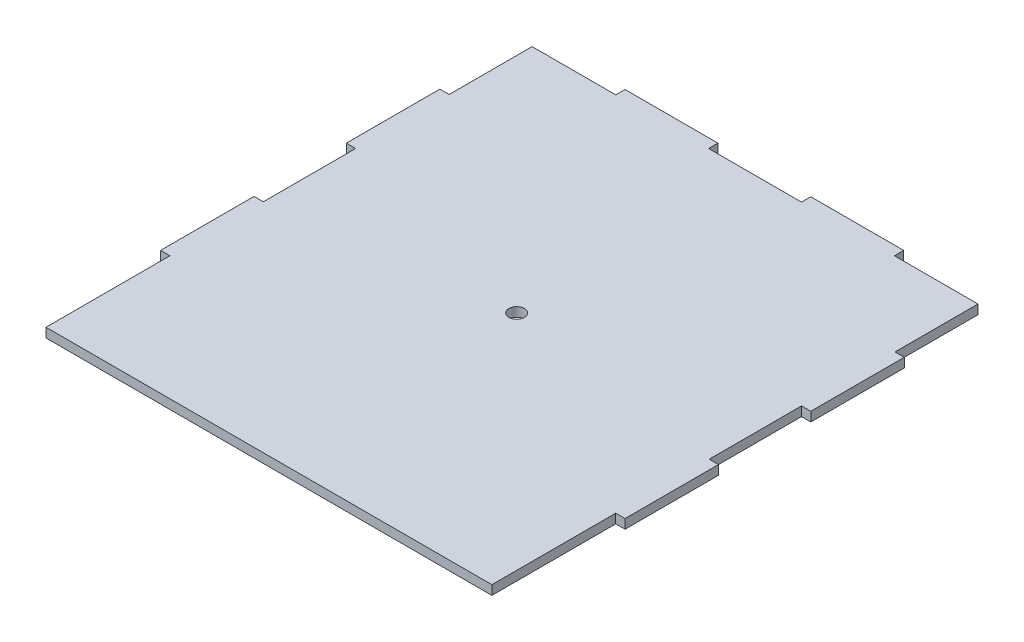
ISO-10303-21;
HEADER;
FILE_DESCRIPTION(('STEP AP214'),'2;1');
FILE_NAME('part.step','',(''),(''),'','','');
FILE_SCHEMA(('AUTOMOTIVE_DESIGN { 1 0 10303 214 1 1 1 1 }'));
ENDSEC;
DATA;
#1=APPLICATION_CONTEXT('core data for automotive mechanical design processes');
#2=APPLICATION_PROTOCOL_DEFINITION('international standard','automotive_design',2000,#1);
#3=PRODUCT_CONTEXT('',#1,'mechanical');
#4=PRODUCT('Part','Part','',(#3));
#5=PRODUCT_RELATED_PRODUCT_CATEGORY('part','',(#4));
#6=PRODUCT_DEFINITION_FORMATION('','',#4);
#7=PRODUCT_DEFINITION_CONTEXT('part definition',#1,'design');
#8=PRODUCT_DEFINITION('design','',#6,#7);
#9=PRODUCT_DEFINITION_SHAPE('','',#8);
#10=(LENGTH_UNIT() NAMED_UNIT(*) SI_UNIT(.MILLI.,.METRE.));
#11=(NAMED_UNIT(*) PLANE_ANGLE_UNIT() SI_UNIT($,.RADIAN.));
#12=(NAMED_UNIT(*) SI_UNIT($,.STERADIAN.) SOLID_ANGLE_UNIT());
#13=UNCERTAINTY_MEASURE_WITH_UNIT(LENGTH_MEASURE(1.E-05),#10,'distance_accuracy_value','');
#14=(GEOMETRIC_REPRESENTATION_CONTEXT(3) GLOBAL_UNCERTAINTY_ASSIGNED_CONTEXT((#13)) GLOBAL_UNIT_ASSIGNED_CONTEXT((#10,
#11,#12)) REPRESENTATION_CONTEXT('',''));
#15=CARTESIAN_POINT('',(0.,0.,0.));
#16=DIRECTION('',(0.,0.,1.));
#17=DIRECTION('',(1.,0.,0.));
#18=AXIS2_PLACEMENT_3D('',#15,#16,#17);
#19=CARTESIAN_POINT('',(0.,3.,0.));
#20=DIRECTION('',(0.,0.,-1.));
#21=DIRECTION('',(-1.,0.,0.));
#22=AXIS2_PLACEMENT_3D('',#19,#20,#21);
#23=PLANE('',#22);
#24=DIRECTION('',(1.,0.,0.));
#25=VECTOR('',#24,1.);
#26=CARTESIAN_POINT('',(0.,0.,0.));
#27=LINE('',#26,#25);
#28=CARTESIAN_POINT('',(3.00000000000114,0.,0.));
#29=VERTEX_POINT('',#28);
#30=CARTESIAN_POINT('',(147.,0.,0.));
#31=VERTEX_POINT('',#30);
#32=EDGE_CURVE('E259',#29,#31,#27,.T.);
#33=ORIENTED_EDGE('',*,*,#32,.T.);
#34=DIRECTION('',(0.,-1.,0.));
#35=VECTOR('',#34,1.);
#36=CARTESIAN_POINT('',(147.,3.,0.));
#37=LINE('',#36,#35);
#38=CARTESIAN_POINT('',(147.,3.,0.));
#39=VERTEX_POINT('',#38);
#40=EDGE_CURVE('E11',#39,#31,#37,.T.);
#41=ORIENTED_EDGE('',*,*,#40,.F.);
#42=DIRECTION('',(1.,0.,0.));
#43=VECTOR('',#42,1.);
#44=CARTESIAN_POINT('',(0.,3.,0.));
#45=LINE('',#44,#43);
#46=CARTESIAN_POINT('',(3.00000000000114,3.,0.));
#47=VERTEX_POINT('',#46);
#48=EDGE_CURVE('E796',#47,#39,#45,.T.);
#49=ORIENTED_EDGE('',*,*,#48,.F.);
#50=DIRECTION('',(0.,-1.,0.));
#51=VECTOR('',#50,1.);
#52=CARTESIAN_POINT('',(3.00000000000114,3.,0.));
#53=LINE('',#52,#51);
#54=EDGE_CURVE('E53',#47,#29,#53,.T.);
#55=ORIENTED_EDGE('',*,*,#54,.T.);
#56=EDGE_LOOP('',(#33,#41,#49,#55));
#57=FACE_BOUND('',#56,.T.);
#58=ADVANCED_FACE('F36',(#57),#23,.F.);
#59=CARTESIAN_POINT('',(147.,3.,0.));
#60=DIRECTION('',(-1.,0.,0.));
#61=DIRECTION('',(0.,0.,1.));
#62=AXIS2_PLACEMENT_3D('',#59,#60,#61);
#63=PLANE('',#62);
#64=DIRECTION('',(0.,0.,-1.));
#65=VECTOR('',#64,1.);
#66=CARTESIAN_POINT('',(147.,0.,0.));
#67=LINE('',#66,#65);
#68=CARTESIAN_POINT('',(147.,0.,-40.));
#69=VERTEX_POINT('',#68);
#70=EDGE_CURVE('E261',#31,#69,#67,.T.);
#71=ORIENTED_EDGE('',*,*,#70,.T.);
#72=DIRECTION('',(0.,-1.,0.));
#73=VECTOR('',#72,1.);
#74=CARTESIAN_POINT('',(147.,3.,-40.));
#75=LINE('',#74,#73);
#76=CARTESIAN_POINT('',(147.,3.,-40.));
#77=VERTEX_POINT('',#76);
#78=EDGE_CURVE('E45',#77,#69,#75,.T.);
#79=ORIENTED_EDGE('',*,*,#78,.F.);
#80=DIRECTION('',(0.,0.,-1.));
#81=VECTOR('',#80,1.);
#82=CARTESIAN_POINT('',(147.,3.,0.));
#83=LINE('',#82,#81);
#84=EDGE_CURVE('E151',#39,#77,#83,.T.);
#85=ORIENTED_EDGE('',*,*,#84,.F.);
#86=ORIENTED_EDGE('',*,*,#40,.T.);
#87=EDGE_LOOP('',(#71,#79,#85,#86));
#88=FACE_BOUND('',#87,.T.);
#89=ADVANCED_FACE('F470',(#88),#63,.F.);
#90=CARTESIAN_POINT('',(0.,3.,-40.));
#91=DIRECTION('',(0.,0.,-1.));
#92=DIRECTION('',(-1.,0.,0.));
#93=AXIS2_PLACEMENT_3D('',#90,#91,#92);
#94=PLANE('',#93);
#95=DIRECTION('',(1.,0.,0.));
#96=VECTOR('',#95,1.);
#97=CARTESIAN_POINT('',(0.,0.,-40.));
#98=LINE('',#97,#96);
#99=CARTESIAN_POINT('',(150.,0.,-40.));
#100=VERTEX_POINT('',#99);
#101=EDGE_CURVE('E263',#69,#100,#98,.T.);
#102=ORIENTED_EDGE('',*,*,#101,.T.);
#103=DIRECTION('',(0.,-1.,0.));
#104=VECTOR('',#103,1.);
#105=CARTESIAN_POINT('',(150.,3.,-40.));
#106=LINE('',#105,#104);
#107=CARTESIAN_POINT('',(150.,3.,-40.));
#108=VERTEX_POINT('',#107);
#109=EDGE_CURVE('E381',#108,#100,#106,.T.);
#110=ORIENTED_EDGE('',*,*,#109,.F.);
#111=DIRECTION('',(1.,0.,0.));
#112=VECTOR('',#111,1.);
#113=CARTESIAN_POINT('',(0.,3.,-40.));
#114=LINE('',#113,#112);
#115=EDGE_CURVE('E389',#77,#108,#114,.T.);
#116=ORIENTED_EDGE('',*,*,#115,.F.);
#117=ORIENTED_EDGE('',*,*,#78,.T.);
#118=EDGE_LOOP('',(#102,#110,#116,#117));
#119=FACE_BOUND('',#118,.T.);
#120=ADVANCED_FACE('F387',(#119),#94,.F.);
#121=CARTESIAN_POINT('',(150.,3.,0.));
#122=DIRECTION('',(-1.,0.,0.));
#123=DIRECTION('',(0.,0.,1.));
#124=AXIS2_PLACEMENT_3D('',#121,#122,#123);
#125=PLANE('',#124);
#126=DIRECTION('',(0.,0.,-1.));
#127=VECTOR('',#126,1.);
#128=CARTESIAN_POINT('',(150.,0.,0.));
#129=LINE('',#128,#127);
#130=CARTESIAN_POINT('',(150.,0.,-70.2));
#131=VERTEX_POINT('',#130);
#132=EDGE_CURVE('E265',#100,#131,#129,.T.);
#133=ORIENTED_EDGE('',*,*,#132,.T.);
#134=DIRECTION('',(0.,-1.,0.));
#135=VECTOR('',#134,1.);
#136=CARTESIAN_POINT('',(150.,3.,-70.2));
#137=LINE('',#136,#135);
#138=CARTESIAN_POINT('',(150.,3.,-70.2));
#139=VERTEX_POINT('',#138);
#140=EDGE_CURVE('E378',#139,#131,#137,.T.);
#141=ORIENTED_EDGE('',*,*,#140,.F.);
#142=DIRECTION('',(0.,0.,-1.));
#143=VECTOR('',#142,1.);
#144=CARTESIAN_POINT('',(150.,3.,0.));
#145=LINE('',#144,#143);
#146=EDGE_CURVE('E406',#108,#139,#145,.T.);
#147=ORIENTED_EDGE('',*,*,#146,.F.);
#148=ORIENTED_EDGE('',*,*,#109,.T.);
#149=EDGE_LOOP('',(#133,#141,#147,#148));
#150=FACE_BOUND('',#149,.T.);
#151=ADVANCED_FACE('F397',(#150),#125,.F.);
#152=CARTESIAN_POINT('',(0.,3.,-70.2));
#153=DIRECTION('',(0.,0.,1.));
#154=DIRECTION('',(1.,0.,0.));
#155=AXIS2_PLACEMENT_3D('',#152,#153,#154);
#156=PLANE('',#155);
#157=DIRECTION('',(-1.,0.,0.));
#158=VECTOR('',#157,1.);
#159=CARTESIAN_POINT('',(0.,0.,-70.2));
#160=LINE('',#159,#158);
#161=CARTESIAN_POINT('',(147.,0.,-70.2));
#162=VERTEX_POINT('',#161);
#163=EDGE_CURVE('E267',#131,#162,#160,.T.);
#164=ORIENTED_EDGE('',*,*,#163,.T.);
#165=DIRECTION('',(0.,-1.,0.));
#166=VECTOR('',#165,1.);
#167=CARTESIAN_POINT('',(147.,3.,-70.2));
#168=LINE('',#167,#166);
#169=CARTESIAN_POINT('',(147.,3.,-70.2));
#170=VERTEX_POINT('',#169);
#171=EDGE_CURVE('E375',#170,#162,#168,.T.);
#172=ORIENTED_EDGE('',*,*,#171,.F.);
#173=DIRECTION('',(-1.,0.,0.));
#174=VECTOR('',#173,1.);
#175=CARTESIAN_POINT('',(0.,3.,-70.2));
#176=LINE('',#175,#174);
#177=EDGE_CURVE('E403',#139,#170,#176,.T.);
#178=ORIENTED_EDGE('',*,*,#177,.F.);
#179=ORIENTED_EDGE('',*,*,#140,.T.);
#180=EDGE_LOOP('',(#164,#172,#178,#179));
#181=FACE_BOUND('',#180,.T.);
#182=ADVANCED_FACE('F401',(#181),#156,.F.);
#183=CARTESIAN_POINT('',(147.,3.,-1.36915087768371E-13));
#184=DIRECTION('',(-1.,0.,0.));
#185=DIRECTION('',(0.,0.,1.));
#186=AXIS2_PLACEMENT_3D('',#183,#184,#185);
#187=PLANE('',#186);
#188=DIRECTION('',(0.,0.,-1.));
#189=VECTOR('',#188,1.);
#190=CARTESIAN_POINT('',(147.,0.,-1.36915087768371E-13));
#191=LINE('',#190,#189);
#192=CARTESIAN_POINT('',(147.,0.,-100.));
#193=VERTEX_POINT('',#192);
#194=EDGE_CURVE('E270',#162,#193,#191,.T.);
#195=ORIENTED_EDGE('',*,*,#194,.T.);
#196=DIRECTION('',(0.,-1.,0.));
#197=VECTOR('',#196,1.);
#198=CARTESIAN_POINT('',(147.,3.,-100.));
#199=LINE('',#198,#197);
#200=CARTESIAN_POINT('',(147.,3.,-100.));
#201=VERTEX_POINT('',#200);
#202=EDGE_CURVE('E373',#201,#193,#199,.T.);
#203=ORIENTED_EDGE('',*,*,#202,.F.);
#204=DIRECTION('',(0.,0.,-1.));
#205=VECTOR('',#204,1.);
#206=CARTESIAN_POINT('',(147.,3.,-1.36915087768371E-13));
#207=LINE('',#206,#205);
#208=EDGE_CURVE('E405',#170,#201,#207,.T.);
#209=ORIENTED_EDGE('',*,*,#208,.F.);
#210=ORIENTED_EDGE('',*,*,#171,.T.);
#211=EDGE_LOOP('',(#195,#203,#209,#210));
#212=FACE_BOUND('',#211,.T.);
#213=ADVANCED_FACE('F480',(#212),#187,.F.);
#214=CARTESIAN_POINT('',(0.,3.,-100.));
#215=DIRECTION('',(0.,0.,1.));
#216=DIRECTION('',(1.,0.,0.));
#217=AXIS2_PLACEMENT_3D('',#214,#215,#216);
#218=PLANE('',#217);
#219=DIRECTION('',(-1.,0.,0.));
#220=VECTOR('',#219,1.);
#221=CARTESIAN_POINT('',(0.,0.,-100.));
#222=LINE('',#221,#220);
#223=CARTESIAN_POINT('',(150.,0.,-100.));
#224=VERTEX_POINT('',#223);
#225=EDGE_CURVE('E273',#224,#193,#222,.T.);
#226=ORIENTED_EDGE('',*,*,#225,.F.);
#227=DIRECTION('',(0.,-1.,0.));
#228=VECTOR('',#227,1.);
#229=CARTESIAN_POINT('',(150.,3.,-100.));
#230=LINE('',#229,#228);
#231=CARTESIAN_POINT('',(150.,3.,-100.));
#232=VERTEX_POINT('',#231);
#233=EDGE_CURVE('E371',#232,#224,#230,.T.);
#234=ORIENTED_EDGE('',*,*,#233,.F.);
#235=DIRECTION('',(-1.,0.,0.));
#236=VECTOR('',#235,1.);
#237=CARTESIAN_POINT('',(0.,3.,-100.));
#238=LINE('',#237,#236);
#239=EDGE_CURVE('E408',#232,#201,#238,.T.);
#240=ORIENTED_EDGE('',*,*,#239,.T.);
#241=ORIENTED_EDGE('',*,*,#202,.T.);
#242=EDGE_LOOP('',(#226,#234,#240,#241));
#243=FACE_BOUND('',#242,.T.);
#244=ADVANCED_FACE('F483',(#243),#218,.T.);
#245=CARTESIAN_POINT('',(150.,0.,-130.2));
#246=VERTEX_POINT('',#245);
#247=EDGE_CURVE('E268',#224,#246,#129,.T.);
#248=ORIENTED_EDGE('',*,*,#247,.T.);
#249=DIRECTION('',(0.,-1.,0.));
#250=VECTOR('',#249,1.);
#251=CARTESIAN_POINT('',(150.,3.,-130.2));
#252=LINE('',#251,#250);
#253=CARTESIAN_POINT('',(150.,3.,-130.2));
#254=VERTEX_POINT('',#253);
#255=EDGE_CURVE('E368',#254,#246,#252,.T.);
#256=ORIENTED_EDGE('',*,*,#255,.F.);
#257=EDGE_CURVE('E411',#232,#254,#145,.T.);
#258=ORIENTED_EDGE('',*,*,#257,.F.);
#259=ORIENTED_EDGE('',*,*,#233,.T.);
#260=EDGE_LOOP('',(#248,#256,#258,#259));
#261=FACE_BOUND('',#260,.T.);
#262=ADVANCED_FACE('F487',(#261),#125,.F.);
#263=CARTESIAN_POINT('',(0.,3.,-130.2));
#264=DIRECTION('',(0.,0.,1.));
#265=DIRECTION('',(1.,0.,0.));
#266=AXIS2_PLACEMENT_3D('',#263,#264,#265);
#267=PLANE('',#266);
#268=DIRECTION('',(-1.,0.,0.));
#269=VECTOR('',#268,1.);
#270=CARTESIAN_POINT('',(0.,0.,-130.2));
#271=LINE('',#270,#269);
#272=CARTESIAN_POINT('',(147.,0.,-130.2));
#273=VERTEX_POINT('',#272);
#274=EDGE_CURVE('E276',#246,#273,#271,.T.);
#275=ORIENTED_EDGE('',*,*,#274,.T.);
#276=DIRECTION('',(0.,-1.,0.));
#277=VECTOR('',#276,1.);
#278=CARTESIAN_POINT('',(147.,3.,-130.2));
#279=LINE('',#278,#277);
#280=CARTESIAN_POINT('',(147.,3.,-130.2));
#281=VERTEX_POINT('',#280);
#282=EDGE_CURVE('E365',#281,#273,#279,.T.);
#283=ORIENTED_EDGE('',*,*,#282,.F.);
#284=DIRECTION('',(-1.,0.,0.));
#285=VECTOR('',#284,1.);
#286=CARTESIAN_POINT('',(0.,3.,-130.2));
#287=LINE('',#286,#285);
#288=EDGE_CURVE('E416',#254,#281,#287,.T.);
#289=ORIENTED_EDGE('',*,*,#288,.F.);
#290=ORIENTED_EDGE('',*,*,#255,.T.);
#291=EDGE_LOOP('',(#275,#283,#289,#290));
#292=FACE_BOUND('',#291,.T.);
#293=ADVANCED_FACE('F491',(#292),#267,.F.);
#294=CARTESIAN_POINT('',(147.,3.,0.));
#295=DIRECTION('',(-1.,0.,0.));
#296=DIRECTION('',(0.,0.,1.));
#297=AXIS2_PLACEMENT_3D('',#294,#295,#296);
#298=PLANE('',#297);
#299=DIRECTION('',(0.,0.,-1.));
#300=VECTOR('',#299,1.);
#301=CARTESIAN_POINT('',(147.,0.,0.));
#302=LINE('',#301,#300);
#303=CARTESIAN_POINT('',(147.,0.,-157.));
#304=VERTEX_POINT('',#303);
#305=EDGE_CURVE('E278',#273,#304,#302,.T.);
#306=ORIENTED_EDGE('',*,*,#305,.T.);
#307=DIRECTION('',(0.,-1.,0.));
#308=VECTOR('',#307,1.);
#309=CARTESIAN_POINT('',(147.,3.,-157.));
#310=LINE('',#309,#308);
#311=CARTESIAN_POINT('',(147.,3.,-157.));
#312=VERTEX_POINT('',#311);
#313=EDGE_CURVE('E362',#312,#304,#310,.T.);
#314=ORIENTED_EDGE('',*,*,#313,.F.);
#315=DIRECTION('',(0.,0.,-1.));
#316=VECTOR('',#315,1.);
#317=CARTESIAN_POINT('',(147.,3.,0.));
#318=LINE('',#317,#316);
#319=EDGE_CURVE('E418',#281,#312,#318,.T.);
#320=ORIENTED_EDGE('',*,*,#319,.F.);
#321=ORIENTED_EDGE('',*,*,#282,.T.);
#322=EDGE_LOOP('',(#306,#314,#320,#321));
#323=FACE_BOUND('',#322,.T.);
#324=ADVANCED_FACE('F495',(#323),#298,.F.);
#325=CARTESIAN_POINT('',(0.,3.,-157.));
#326=DIRECTION('',(0.,0.,1.));
#327=DIRECTION('',(1.,0.,0.));
#328=AXIS2_PLACEMENT_3D('',#325,#326,#327);
#329=PLANE('',#328);
#330=DIRECTION('',(-1.,0.,0.));
#331=VECTOR('',#330,1.);
#332=CARTESIAN_POINT('',(0.,0.,-157.));
#333=LINE('',#332,#331);
#334=CARTESIAN_POINT('',(120.,0.,-157.));
#335=VERTEX_POINT('',#334);
#336=EDGE_CURVE('E280',#304,#335,#333,.T.);
#337=ORIENTED_EDGE('',*,*,#336,.T.);
#338=DIRECTION('',(0.,-1.,0.));
#339=VECTOR('',#338,1.);
#340=CARTESIAN_POINT('',(120.,3.,-157.));
#341=LINE('',#340,#339);
#342=CARTESIAN_POINT('',(120.,3.,-157.));
#343=VERTEX_POINT('',#342);
#344=EDGE_CURVE('E360',#343,#335,#341,.T.);
#345=ORIENTED_EDGE('',*,*,#344,.F.);
#346=DIRECTION('',(-1.,0.,0.));
#347=VECTOR('',#346,1.);
#348=CARTESIAN_POINT('',(0.,3.,-157.));
#349=LINE('',#348,#347);
#350=EDGE_CURVE('E420',#312,#343,#349,.T.);
#351=ORIENTED_EDGE('',*,*,#350,.F.);
#352=ORIENTED_EDGE('',*,*,#313,.T.);
#353=EDGE_LOOP('',(#337,#345,#351,#352));
#354=FACE_BOUND('',#353,.T.);
#355=ADVANCED_FACE('F499',(#354),#329,.F.);
#356=CARTESIAN_POINT('',(120.,3.,0.));
#357=DIRECTION('',(1.,0.,0.));
#358=DIRECTION('',(0.,0.,-1.));
#359=AXIS2_PLACEMENT_3D('',#356,#357,#358);
#360=PLANE('',#359);
#361=DIRECTION('',(0.,0.,1.));
#362=VECTOR('',#361,1.);
#363=CARTESIAN_POINT('',(120.,0.,0.));
#364=LINE('',#363,#362);
#365=CARTESIAN_POINT('',(120.,0.,-160.));
#366=VERTEX_POINT('',#365);
#367=EDGE_CURVE('E283',#366,#335,#364,.T.);
#368=ORIENTED_EDGE('',*,*,#367,.F.);
#369=DIRECTION('',(0.,-1.,0.));
#370=VECTOR('',#369,1.);
#371=CARTESIAN_POINT('',(120.,3.,-160.));
#372=LINE('',#371,#370);
#373=CARTESIAN_POINT('',(120.,3.,-160.));
#374=VERTEX_POINT('',#373);
#375=EDGE_CURVE('E358',#374,#366,#372,.T.);
#376=ORIENTED_EDGE('',*,*,#375,.F.);
#377=DIRECTION('',(0.,0.,1.));
#378=VECTOR('',#377,1.);
#379=CARTESIAN_POINT('',(120.,3.,0.));
#380=LINE('',#379,#378);
#381=EDGE_CURVE('E422',#374,#343,#380,.T.);
#382=ORIENTED_EDGE('',*,*,#381,.T.);
#383=ORIENTED_EDGE('',*,*,#344,.T.);
#384=EDGE_LOOP('',(#368,#376,#382,#383));
#385=FACE_BOUND('',#384,.T.);
#386=ADVANCED_FACE('F503',(#385),#360,.T.);
#387=CARTESIAN_POINT('',(0.,3.,-160.));
#388=DIRECTION('',(0.,0.,-1.));
#389=DIRECTION('',(-1.,0.,0.));
#390=AXIS2_PLACEMENT_3D('',#387,#388,#389);
#391=PLANE('',#390);
#392=DIRECTION('',(1.,0.,0.));
#393=VECTOR('',#392,1.);
#394=CARTESIAN_POINT('',(0.,0.,-160.));
#395=LINE('',#394,#393);
#396=CARTESIAN_POINT('',(90.,0.,-160.));
#397=VERTEX_POINT('',#396);
#398=EDGE_CURVE('E286',#397,#366,#395,.T.);
#399=ORIENTED_EDGE('',*,*,#398,.F.);
#400=DIRECTION('',(0.,-1.,0.));
#401=VECTOR('',#400,1.);
#402=CARTESIAN_POINT('',(90.,3.,-160.));
#403=LINE('',#402,#401);
#404=CARTESIAN_POINT('',(90.,3.,-160.));
#405=VERTEX_POINT('',#404);
#406=EDGE_CURVE('E356',#405,#397,#403,.T.);
#407=ORIENTED_EDGE('',*,*,#406,.F.);
#408=DIRECTION('',(1.,0.,0.));
#409=VECTOR('',#408,1.);
#410=CARTESIAN_POINT('',(0.,3.,-160.));
#411=LINE('',#410,#409);
#412=EDGE_CURVE('E425',#405,#374,#411,.T.);
#413=ORIENTED_EDGE('',*,*,#412,.T.);
#414=ORIENTED_EDGE('',*,*,#375,.T.);
#415=EDGE_LOOP('',(#399,#407,#413,#414));
#416=FACE_BOUND('',#415,.T.);
#417=ADVANCED_FACE('F507',(#416),#391,.T.);
#418=CARTESIAN_POINT('',(90.,3.,0.));
#419=DIRECTION('',(1.,0.,0.));
#420=DIRECTION('',(0.,0.,-1.));
#421=AXIS2_PLACEMENT_3D('',#418,#419,#420);
#422=PLANE('',#421);
#423=DIRECTION('',(0.,0.,1.));
#424=VECTOR('',#423,1.);
#425=CARTESIAN_POINT('',(90.,0.,0.));
#426=LINE('',#425,#424);
#427=CARTESIAN_POINT('',(90.,0.,-157.));
#428=VERTEX_POINT('',#427);
#429=EDGE_CURVE('E289',#397,#428,#426,.T.);
#430=ORIENTED_EDGE('',*,*,#429,.T.);
#431=DIRECTION('',(0.,-1.,0.));
#432=VECTOR('',#431,1.);
#433=CARTESIAN_POINT('',(90.,3.,-157.));
#434=LINE('',#433,#432);
#435=CARTESIAN_POINT('',(90.,3.,-157.));
#436=VERTEX_POINT('',#435);
#437=EDGE_CURVE('E353',#436,#428,#434,.T.);
#438=ORIENTED_EDGE('',*,*,#437,.F.);
#439=DIRECTION('',(0.,0.,1.));
#440=VECTOR('',#439,1.);
#441=CARTESIAN_POINT('',(90.,3.,0.));
#442=LINE('',#441,#440);
#443=EDGE_CURVE('E428',#405,#436,#442,.T.);
#444=ORIENTED_EDGE('',*,*,#443,.F.);
#445=ORIENTED_EDGE('',*,*,#406,.T.);
#446=EDGE_LOOP('',(#430,#438,#444,#445));
#447=FACE_BOUND('',#446,.T.);
#448=ADVANCED_FACE('F511',(#447),#422,.F.);
#449=CARTESIAN_POINT('',(0.,3.,-157.));
#450=DIRECTION('',(0.,0.,1.));
#451=DIRECTION('',(1.,0.,0.));
#452=AXIS2_PLACEMENT_3D('',#449,#450,#451);
#453=PLANE('',#452);
#454=DIRECTION('',(-1.,0.,0.));
#455=VECTOR('',#454,1.);
#456=CARTESIAN_POINT('',(0.,0.,-157.));
#457=LINE('',#456,#455);
#458=CARTESIAN_POINT('',(60.,0.,-157.));
#459=VERTEX_POINT('',#458);
#460=EDGE_CURVE('E291',#428,#459,#457,.T.);
#461=ORIENTED_EDGE('',*,*,#460,.T.);
#462=DIRECTION('',(0.,-1.,0.));
#463=VECTOR('',#462,1.);
#464=CARTESIAN_POINT('',(60.,3.,-157.));
#465=LINE('',#464,#463);
#466=CARTESIAN_POINT('',(60.,3.,-157.));
#467=VERTEX_POINT('',#466);
#468=EDGE_CURVE('E351',#467,#459,#465,.T.);
#469=ORIENTED_EDGE('',*,*,#468,.F.);
#470=DIRECTION('',(-1.,0.,0.));
#471=VECTOR('',#470,1.);
#472=CARTESIAN_POINT('',(0.,3.,-157.));
#473=LINE('',#472,#471);
#474=EDGE_CURVE('E430',#436,#467,#473,.T.);
#475=ORIENTED_EDGE('',*,*,#474,.F.);
#476=ORIENTED_EDGE('',*,*,#437,.T.);
#477=EDGE_LOOP('',(#461,#469,#475,#476));
#478=FACE_BOUND('',#477,.T.);
#479=ADVANCED_FACE('F515',(#478),#453,.F.);
#480=CARTESIAN_POINT('',(60.,3.,0.));
#481=DIRECTION('',(1.,0.,0.));
#482=DIRECTION('',(0.,0.,-1.));
#483=AXIS2_PLACEMENT_3D('',#480,#481,#482);
#484=PLANE('',#483);
#485=DIRECTION('',(0.,0.,1.));
#486=VECTOR('',#485,1.);
#487=CARTESIAN_POINT('',(60.,0.,0.));
#488=LINE('',#487,#486);
#489=CARTESIAN_POINT('',(60.,0.,-160.));
#490=VERTEX_POINT('',#489);
#491=EDGE_CURVE('E294',#490,#459,#488,.T.);
#492=ORIENTED_EDGE('',*,*,#491,.F.);
#493=DIRECTION('',(0.,-1.,0.));
#494=VECTOR('',#493,1.);
#495=CARTESIAN_POINT('',(60.,3.,-160.));
#496=LINE('',#495,#494);
#497=CARTESIAN_POINT('',(60.,3.,-160.));
#498=VERTEX_POINT('',#497);
#499=EDGE_CURVE('E349',#498,#490,#496,.T.);
#500=ORIENTED_EDGE('',*,*,#499,.F.);
#501=DIRECTION('',(0.,0.,1.));
#502=VECTOR('',#501,1.);
#503=CARTESIAN_POINT('',(60.,3.,0.));
#504=LINE('',#503,#502);
#505=EDGE_CURVE('E432',#498,#467,#504,.T.);
#506=ORIENTED_EDGE('',*,*,#505,.T.);
#507=ORIENTED_EDGE('',*,*,#468,.T.);
#508=EDGE_LOOP('',(#492,#500,#506,#507));
#509=FACE_BOUND('',#508,.T.);
#510=ADVANCED_FACE('F519',(#509),#484,.T.);
#511=CARTESIAN_POINT('',(0.,3.,-160.));
#512=DIRECTION('',(0.,0.,-1.));
#513=DIRECTION('',(-1.,0.,0.));
#514=AXIS2_PLACEMENT_3D('',#511,#512,#513);
#515=PLANE('',#514);
#516=DIRECTION('',(1.,0.,0.));
#517=VECTOR('',#516,1.);
#518=CARTESIAN_POINT('',(0.,0.,-160.));
#519=LINE('',#518,#517);
#520=CARTESIAN_POINT('',(30.,0.,-160.));
#521=VERTEX_POINT('',#520);
#522=EDGE_CURVE('E297',#521,#490,#519,.T.);
#523=ORIENTED_EDGE('',*,*,#522,.F.);
#524=DIRECTION('',(0.,-1.,0.));
#525=VECTOR('',#524,1.);
#526=CARTESIAN_POINT('',(30.,3.,-160.));
#527=LINE('',#526,#525);
#528=CARTESIAN_POINT('',(30.,3.,-160.));
#529=VERTEX_POINT('',#528);
#530=EDGE_CURVE('E347',#529,#521,#527,.T.);
#531=ORIENTED_EDGE('',*,*,#530,.F.);
#532=DIRECTION('',(1.,0.,0.));
#533=VECTOR('',#532,1.);
#534=CARTESIAN_POINT('',(0.,3.,-160.));
#535=LINE('',#534,#533);
#536=EDGE_CURVE('E435',#529,#498,#535,.T.);
#537=ORIENTED_EDGE('',*,*,#536,.T.);
#538=ORIENTED_EDGE('',*,*,#499,.T.);
#539=EDGE_LOOP('',(#523,#531,#537,#538));
#540=FACE_BOUND('',#539,.T.);
#541=ADVANCED_FACE('F523',(#540),#515,.T.);
#542=CARTESIAN_POINT('',(30.,3.,0.));
#543=DIRECTION('',(1.,0.,0.));
#544=DIRECTION('',(0.,0.,-1.));
#545=AXIS2_PLACEMENT_3D('',#542,#543,#544);
#546=PLANE('',#545);
#547=DIRECTION('',(0.,0.,1.));
#548=VECTOR('',#547,1.);
#549=CARTESIAN_POINT('',(30.,0.,0.));
#550=LINE('',#549,#548);
#551=CARTESIAN_POINT('',(30.,0.,-156.999999999999));
#552=VERTEX_POINT('',#551);
#553=EDGE_CURVE('E300',#521,#552,#550,.T.);
#554=ORIENTED_EDGE('',*,*,#553,.T.);
#555=DIRECTION('',(0.,-1.,0.));
#556=VECTOR('',#555,1.);
#557=CARTESIAN_POINT('',(30.,3.,-156.999999999999));
#558=LINE('',#557,#556);
#559=CARTESIAN_POINT('',(30.,3.,-156.999999999999));
#560=VERTEX_POINT('',#559);
#561=EDGE_CURVE('E344',#560,#552,#558,.T.);
#562=ORIENTED_EDGE('',*,*,#561,.F.);
#563=DIRECTION('',(0.,0.,1.));
#564=VECTOR('',#563,1.);
#565=CARTESIAN_POINT('',(30.,3.,0.));
#566=LINE('',#565,#564);
#567=EDGE_CURVE('E438',#529,#560,#566,.T.);
#568=ORIENTED_EDGE('',*,*,#567,.F.);
#569=ORIENTED_EDGE('',*,*,#530,.T.);
#570=EDGE_LOOP('',(#554,#562,#568,#569));
#571=FACE_BOUND('',#570,.T.);
#572=ADVANCED_FACE('F527',(#571),#546,.F.);
#573=CARTESIAN_POINT('',(0.,3.,-156.999999999999));
#574=DIRECTION('',(0.,0.,1.));
#575=DIRECTION('',(1.,0.,0.));
#576=AXIS2_PLACEMENT_3D('',#573,#574,#575);
#577=PLANE('',#576);
#578=DIRECTION('',(-1.,0.,0.));
#579=VECTOR('',#578,1.);
#580=CARTESIAN_POINT('',(0.,0.,-156.999999999999));
#581=LINE('',#580,#579);
#582=CARTESIAN_POINT('',(3.00000000000008,0.,-156.999999999999));
#583=VERTEX_POINT('',#582);
#584=EDGE_CURVE('E302',#552,#583,#581,.T.);
#585=ORIENTED_EDGE('',*,*,#584,.T.);
#586=DIRECTION('',(0.,-1.,0.));
#587=VECTOR('',#586,1.);
#588=CARTESIAN_POINT('',(3.00000000000008,3.,-156.999999999999));
#589=LINE('',#588,#587);
#590=CARTESIAN_POINT('',(3.00000000000008,3.,-156.999999999999));
#591=VERTEX_POINT('',#590);
#592=EDGE_CURVE('E342',#591,#583,#589,.T.);
#593=ORIENTED_EDGE('',*,*,#592,.F.);
#594=DIRECTION('',(-1.,0.,0.));
#595=VECTOR('',#594,1.);
#596=CARTESIAN_POINT('',(0.,3.,-156.999999999999));
#597=LINE('',#596,#595);
#598=EDGE_CURVE('E440',#560,#591,#597,.T.);
#599=ORIENTED_EDGE('',*,*,#598,.F.);
#600=ORIENTED_EDGE('',*,*,#561,.T.);
#601=EDGE_LOOP('',(#585,#593,#599,#600));
#602=FACE_BOUND('',#601,.T.);
#603=ADVANCED_FACE('F531',(#602),#577,.F.);
#604=CARTESIAN_POINT('',(3.0000000000011,3.,0.));
#605=DIRECTION('',(-1.,0.,0.));
#606=DIRECTION('',(0.,0.,1.));
#607=AXIS2_PLACEMENT_3D('',#604,#605,#606);
#608=PLANE('',#607);
#609=DIRECTION('',(0.,0.,-1.));
#610=VECTOR('',#609,1.);
#611=CARTESIAN_POINT('',(3.0000000000011,0.,0.));
#612=LINE('',#611,#610);
#613=CARTESIAN_POINT('',(3.00000000000025,0.,-130.2));
#614=VERTEX_POINT('',#613);
#615=EDGE_CURVE('E305',#614,#583,#612,.T.);
#616=ORIENTED_EDGE('',*,*,#615,.F.);
#617=DIRECTION('',(0.,-1.,0.));
#618=VECTOR('',#617,1.);
#619=CARTESIAN_POINT('',(3.00000000000025,3.,-130.2));
#620=LINE('',#619,#618);
#621=CARTESIAN_POINT('',(3.00000000000025,3.,-130.2));
#622=VERTEX_POINT('',#621);
#623=EDGE_CURVE('E340',#622,#614,#620,.T.);
#624=ORIENTED_EDGE('',*,*,#623,.F.);
#625=DIRECTION('',(0.,0.,-1.));
#626=VECTOR('',#625,1.);
#627=CARTESIAN_POINT('',(3.0000000000011,3.,0.));
#628=LINE('',#627,#626);
#629=EDGE_CURVE('E442',#622,#591,#628,.T.);
#630=ORIENTED_EDGE('',*,*,#629,.T.);
#631=ORIENTED_EDGE('',*,*,#592,.T.);
#632=EDGE_LOOP('',(#616,#624,#630,#631));
#633=FACE_BOUND('',#632,.T.);
#634=ADVANCED_FACE('F535',(#633),#608,.T.);
#635=CARTESIAN_POINT('',(0.,3.,-130.2));
#636=DIRECTION('',(0.,0.,-1.));
#637=DIRECTION('',(-1.,0.,0.));
#638=AXIS2_PLACEMENT_3D('',#635,#636,#637);
#639=PLANE('',#638);
#640=DIRECTION('',(1.,0.,0.));
#641=VECTOR('',#640,1.);
#642=CARTESIAN_POINT('',(0.,0.,-130.2));
#643=LINE('',#642,#641);
#644=CARTESIAN_POINT('',(0.,0.,-130.2));
#645=VERTEX_POINT('',#644);
#646=EDGE_CURVE('E308',#645,#614,#643,.T.);
#647=ORIENTED_EDGE('',*,*,#646,.F.);
#648=DIRECTION('',(0.,-1.,0.));
#649=VECTOR('',#648,1.);
#650=CARTESIAN_POINT('',(0.,3.,-130.2));
#651=LINE('',#650,#649);
#652=CARTESIAN_POINT('',(0.,3.,-130.2));
#653=VERTEX_POINT('',#652);
#654=EDGE_CURVE('E338',#653,#645,#651,.T.);
#655=ORIENTED_EDGE('',*,*,#654,.F.);
#656=DIRECTION('',(1.,0.,0.));
#657=VECTOR('',#656,1.);
#658=CARTESIAN_POINT('',(0.,3.,-130.2));
#659=LINE('',#658,#657);
#660=EDGE_CURVE('E445',#653,#622,#659,.T.);
#661=ORIENTED_EDGE('',*,*,#660,.T.);
#662=ORIENTED_EDGE('',*,*,#623,.T.);
#663=EDGE_LOOP('',(#647,#655,#661,#662));
#664=FACE_BOUND('',#663,.T.);
#665=ADVANCED_FACE('F539',(#664),#639,.T.);
#666=CARTESIAN_POINT('',(0.,3.,0.));
#667=DIRECTION('',(-1.,0.,0.));
#668=DIRECTION('',(0.,0.,1.));
#669=AXIS2_PLACEMENT_3D('',#666,#667,#668);
#670=PLANE('',#669);
#671=DIRECTION('',(0.,0.,-1.));
#672=VECTOR('',#671,1.);
#673=CARTESIAN_POINT('',(0.,0.,0.));
#674=LINE('',#673,#672);
#675=CARTESIAN_POINT('',(0.,0.,-99.9999999999995));
#676=VERTEX_POINT('',#675);
#677=EDGE_CURVE('E311',#676,#645,#674,.T.);
#678=ORIENTED_EDGE('',*,*,#677,.F.);
#679=DIRECTION('',(0.,-1.,0.));
#680=VECTOR('',#679,1.);
#681=CARTESIAN_POINT('',(0.,3.,-99.9999999999995));
#682=LINE('',#681,#680);
#683=CARTESIAN_POINT('',(0.,3.,-99.9999999999995));
#684=VERTEX_POINT('',#683);
#685=EDGE_CURVE('E336',#684,#676,#682,.T.);
#686=ORIENTED_EDGE('',*,*,#685,.F.);
#687=DIRECTION('',(0.,0.,-1.));
#688=VECTOR('',#687,1.);
#689=CARTESIAN_POINT('',(0.,3.,0.));
#690=LINE('',#689,#688);
#691=EDGE_CURVE('E248',#684,#653,#690,.T.);
#692=ORIENTED_EDGE('',*,*,#691,.T.);
#693=ORIENTED_EDGE('',*,*,#654,.T.);
#694=EDGE_LOOP('',(#678,#686,#692,#693));
#695=FACE_BOUND('',#694,.T.);
#696=ADVANCED_FACE('F543',(#695),#670,.T.);
#697=CARTESIAN_POINT('',(0.,3.,-99.9999999999995));
#698=DIRECTION('',(0.,0.,-1.));
#699=DIRECTION('',(-1.,0.,0.));
#700=AXIS2_PLACEMENT_3D('',#697,#698,#699);
#701=PLANE('',#700);
#702=DIRECTION('',(1.,0.,0.));
#703=VECTOR('',#702,1.);
#704=CARTESIAN_POINT('',(0.,0.,-99.9999999999995));
#705=LINE('',#704,#703);
#706=CARTESIAN_POINT('',(3.0000000000005,0.,-99.9999999999995));
#707=VERTEX_POINT('',#706);
#708=EDGE_CURVE('E314',#676,#707,#705,.T.);
#709=ORIENTED_EDGE('',*,*,#708,.T.);
#710=DIRECTION('',(0.,-1.,0.));
#711=VECTOR('',#710,1.);
#712=CARTESIAN_POINT('',(3.0000000000005,3.,-99.9999999999995));
#713=LINE('',#712,#711);
#714=CARTESIAN_POINT('',(3.0000000000005,3.,-99.9999999999995));
#715=VERTEX_POINT('',#714);
#716=EDGE_CURVE('E334',#715,#707,#713,.T.);
#717=ORIENTED_EDGE('',*,*,#716,.F.);
#718=DIRECTION('',(1.,0.,0.));
#719=VECTOR('',#718,1.);
#720=CARTESIAN_POINT('',(0.,3.,-99.9999999999995));
#721=LINE('',#720,#719);
#722=EDGE_CURVE('E449',#684,#715,#721,.T.);
#723=ORIENTED_EDGE('',*,*,#722,.F.);
#724=ORIENTED_EDGE('',*,*,#685,.T.);
#725=EDGE_LOOP('',(#709,#717,#723,#724));
#726=FACE_BOUND('',#725,.T.);
#727=ADVANCED_FACE('F545',(#726),#701,.F.);
#728=CARTESIAN_POINT('',(3.00000000000106,3.,0.));
#729=DIRECTION('',(-1.,0.,0.));
#730=DIRECTION('',(0.,0.,1.));
#731=AXIS2_PLACEMENT_3D('',#728,#729,#730);
#732=PLANE('',#731);
#733=DIRECTION('',(0.,0.,-1.));
#734=VECTOR('',#733,1.);
#735=CARTESIAN_POINT('',(3.00000000000106,0.,0.));
#736=LINE('',#735,#734);
#737=CARTESIAN_POINT('',(3.00000000000067,0.,-70.1999999999995));
#738=VERTEX_POINT('',#737);
#739=EDGE_CURVE('E317',#738,#707,#736,.T.);
#740=ORIENTED_EDGE('',*,*,#739,.F.);
#741=DIRECTION('',(0.,-1.,0.));
#742=VECTOR('',#741,1.);
#743=CARTESIAN_POINT('',(3.00000000000067,3.,-70.1999999999995));
#744=LINE('',#743,#742);
#745=CARTESIAN_POINT('',(3.00000000000067,3.,-70.1999999999995));
#746=VERTEX_POINT('',#745);
#747=EDGE_CURVE('E332',#746,#738,#744,.T.);
#748=ORIENTED_EDGE('',*,*,#747,.F.);
#749=DIRECTION('',(0.,0.,-1.));
#750=VECTOR('',#749,1.);
#751=CARTESIAN_POINT('',(3.00000000000106,3.,0.));
#752=LINE('',#751,#750);
#753=EDGE_CURVE('E450',#746,#715,#752,.T.);
#754=ORIENTED_EDGE('',*,*,#753,.T.);
#755=ORIENTED_EDGE('',*,*,#716,.T.);
#756=EDGE_LOOP('',(#740,#748,#754,#755));
#757=FACE_BOUND('',#756,.T.);
#758=ADVANCED_FACE('F548',(#757),#732,.T.);
#759=CARTESIAN_POINT('',(0.,3.,-70.1999999999995));
#760=DIRECTION('',(0.,0.,-1.));
#761=DIRECTION('',(-1.,0.,0.));
#762=AXIS2_PLACEMENT_3D('',#759,#760,#761);
#763=PLANE('',#762);
#764=DIRECTION('',(1.,0.,0.));
#765=VECTOR('',#764,1.);
#766=CARTESIAN_POINT('',(0.,0.,-70.1999999999995));
#767=LINE('',#766,#765);
#768=CARTESIAN_POINT('',(0.,0.,-70.1999999999995));
#769=VERTEX_POINT('',#768);
#770=EDGE_CURVE('E320',#769,#738,#767,.T.);
#771=ORIENTED_EDGE('',*,*,#770,.F.);
#772=DIRECTION('',(0.,-1.,0.));
#773=VECTOR('',#772,1.);
#774=CARTESIAN_POINT('',(0.,3.,-70.1999999999995));
#775=LINE('',#774,#773);
#776=CARTESIAN_POINT('',(0.,3.,-70.1999999999995));
#777=VERTEX_POINT('',#776);
#778=EDGE_CURVE('E236',#777,#769,#775,.T.);
#779=ORIENTED_EDGE('',*,*,#778,.F.);
#780=DIRECTION('',(1.,0.,0.));
#781=VECTOR('',#780,1.);
#782=CARTESIAN_POINT('',(0.,3.,-70.1999999999995));
#783=LINE('',#782,#781);
#784=EDGE_CURVE('E246',#777,#746,#783,.T.);
#785=ORIENTED_EDGE('',*,*,#784,.T.);
#786=ORIENTED_EDGE('',*,*,#747,.T.);
#787=EDGE_LOOP('',(#771,#779,#785,#786));
#788=FACE_BOUND('',#787,.T.);
#789=ADVANCED_FACE('F455',(#788),#763,.T.);
#790=CARTESIAN_POINT('',(0.,0.,-39.9999999999996));
#791=VERTEX_POINT('',#790);
#792=EDGE_CURVE('E232',#791,#769,#674,.T.);
#793=ORIENTED_EDGE('',*,*,#792,.F.);
#794=DIRECTION('',(0.,-1.,0.));
#795=VECTOR('',#794,1.);
#796=CARTESIAN_POINT('',(0.,3.,-39.9999999999996));
#797=LINE('',#796,#795);
#798=CARTESIAN_POINT('',(0.,3.,-39.9999999999996));
#799=VERTEX_POINT('',#798);
#800=EDGE_CURVE('E227',#799,#791,#797,.T.);
#801=ORIENTED_EDGE('',*,*,#800,.F.);
#802=EDGE_CURVE('E230',#799,#777,#690,.T.);
#803=ORIENTED_EDGE('',*,*,#802,.T.);
#804=ORIENTED_EDGE('',*,*,#778,.T.);
#805=EDGE_LOOP('',(#793,#801,#803,#804));
#806=FACE_BOUND('',#805,.T.);
#807=ADVANCED_FACE('F229',(#806),#670,.T.);
#808=CARTESIAN_POINT('',(0.,3.,-39.9999999999996));
#809=DIRECTION('',(0.,0.,1.));
#810=DIRECTION('',(1.,0.,0.));
#811=AXIS2_PLACEMENT_3D('',#808,#809,#810);
#812=PLANE('',#811);
#813=DIRECTION('',(-1.,0.,0.));
#814=VECTOR('',#813,1.);
#815=CARTESIAN_POINT('',(0.,0.,-39.9999999999996));
#816=LINE('',#815,#814);
#817=CARTESIAN_POINT('',(3.00000000000086,0.,-39.9999999999996));
#818=VERTEX_POINT('',#817);
#819=EDGE_CURVE('E323',#818,#791,#816,.T.);
#820=ORIENTED_EDGE('',*,*,#819,.F.);
#821=DIRECTION('',(0.,-1.,0.));
#822=VECTOR('',#821,1.);
#823=CARTESIAN_POINT('',(3.00000000000086,3.,-39.9999999999996));
#824=LINE('',#823,#822);
#825=CARTESIAN_POINT('',(3.00000000000086,3.,-39.9999999999996));
#826=VERTEX_POINT('',#825);
#827=EDGE_CURVE('E139',#826,#818,#824,.T.);
#828=ORIENTED_EDGE('',*,*,#827,.F.);
#829=DIRECTION('',(-1.,0.,0.));
#830=VECTOR('',#829,1.);
#831=CARTESIAN_POINT('',(0.,3.,-39.9999999999996));
#832=LINE('',#831,#830);
#833=EDGE_CURVE('E243',#826,#799,#832,.T.);
#834=ORIENTED_EDGE('',*,*,#833,.T.);
#835=ORIENTED_EDGE('',*,*,#800,.T.);
#836=EDGE_LOOP('',(#820,#828,#834,#835));
#837=FACE_BOUND('',#836,.T.);
#838=ADVANCED_FACE('F249',(#837),#812,.T.);
#839=CARTESIAN_POINT('',(75.,3.,-80.));
#840=DIRECTION('',(0.,-1.,0.));
#841=DIRECTION('',(0.,0.,-1.));
#842=AXIS2_PLACEMENT_3D('',#839,#840,#841);
#843=CYLINDRICAL_SURFACE('',#842,2.5);
#844=CARTESIAN_POINT('',(75.,3.,-80.));
#845=DIRECTION('',(0.,1.,0.));
#846=DIRECTION('',(0.,0.,1.));
#847=AXIS2_PLACEMENT_3D('',#844,#845,#846);
#848=CIRCLE('',#847,2.5);
#849=CARTESIAN_POINT('',(75.,3.,-77.5));
#850=VERTEX_POINT('',#849);
#851=EDGE_CURVE('E328',#850,#850,#848,.T.);
#852=ORIENTED_EDGE('',*,*,#851,.T.);
#853=EDGE_LOOP('',(#852));
#854=FACE_BOUND('',#853,.T.);
#855=CARTESIAN_POINT('',(75.,0.,-80.));
#856=DIRECTION('',(0.,1.,0.));
#857=DIRECTION('',(0.,0.,1.));
#858=AXIS2_PLACEMENT_3D('',#855,#856,#857);
#859=CIRCLE('',#858,2.5);
#860=CARTESIAN_POINT('',(75.,0.,-77.5));
#861=VERTEX_POINT('',#860);
#862=EDGE_CURVE('E256',#861,#861,#859,.T.);
#863=ORIENTED_EDGE('',*,*,#862,.F.);
#864=EDGE_LOOP('',(#863));
#865=FACE_BOUND('',#864,.T.);
#866=ADVANCED_FACE('F38',(#854,#865),#843,.F.);
#867=CARTESIAN_POINT('',(3.00000000000114,3.,0.));
#868=DIRECTION('',(-1.,0.,0.));
#869=DIRECTION('',(0.,0.,1.));
#870=AXIS2_PLACEMENT_3D('',#867,#868,#869);
#871=PLANE('',#870);
#872=DIRECTION('',(0.,0.,-1.));
#873=VECTOR('',#872,1.);
#874=CARTESIAN_POINT('',(3.00000000000114,0.,0.));
#875=LINE('',#874,#873);
#876=EDGE_CURVE('E325',#29,#818,#875,.T.);
#877=ORIENTED_EDGE('',*,*,#876,.F.);
#878=ORIENTED_EDGE('',*,*,#54,.F.);
#879=DIRECTION('',(0.,0.,-1.));
#880=VECTOR('',#879,1.);
#881=CARTESIAN_POINT('',(3.00000000000114,3.,0.));
#882=LINE('',#881,#880);
#883=EDGE_CURVE('E250',#47,#826,#882,.T.);
#884=ORIENTED_EDGE('',*,*,#883,.T.);
#885=ORIENTED_EDGE('',*,*,#827,.T.);
#886=EDGE_LOOP('',(#877,#878,#884,#885));
#887=FACE_BOUND('',#886,.T.);
#888=ADVANCED_FACE('F457',(#887),#871,.T.);
#889=CARTESIAN_POINT('',(0.,3.,0.));
#890=DIRECTION('',(0.,1.,0.));
#891=DIRECTION('',(0.,0.,1.));
#892=AXIS2_PLACEMENT_3D('',#889,#890,#891);
#893=PLANE('',#892);
#894=ORIENTED_EDGE('',*,*,#851,.F.);
#895=EDGE_LOOP('',(#894));
#896=FACE_BOUND('',#895,.T.);
#897=ORIENTED_EDGE('',*,*,#48,.T.);
#898=ORIENTED_EDGE('',*,*,#84,.T.);
#899=ORIENTED_EDGE('',*,*,#115,.T.);
#900=ORIENTED_EDGE('',*,*,#146,.T.);
#901=ORIENTED_EDGE('',*,*,#177,.T.);
#902=ORIENTED_EDGE('',*,*,#208,.T.);
#903=ORIENTED_EDGE('',*,*,#239,.F.);
#904=ORIENTED_EDGE('',*,*,#257,.T.);
#905=ORIENTED_EDGE('',*,*,#288,.T.);
#906=ORIENTED_EDGE('',*,*,#319,.T.);
#907=ORIENTED_EDGE('',*,*,#350,.T.);
#908=ORIENTED_EDGE('',*,*,#381,.F.);
#909=ORIENTED_EDGE('',*,*,#412,.F.);
#910=ORIENTED_EDGE('',*,*,#443,.T.);
#911=ORIENTED_EDGE('',*,*,#474,.T.);
#912=ORIENTED_EDGE('',*,*,#505,.F.);
#913=ORIENTED_EDGE('',*,*,#536,.F.);
#914=ORIENTED_EDGE('',*,*,#567,.T.);
#915=ORIENTED_EDGE('',*,*,#598,.T.);
#916=ORIENTED_EDGE('',*,*,#629,.F.);
#917=ORIENTED_EDGE('',*,*,#660,.F.);
#918=ORIENTED_EDGE('',*,*,#691,.F.);
#919=ORIENTED_EDGE('',*,*,#722,.T.);
#920=ORIENTED_EDGE('',*,*,#753,.F.);
#921=ORIENTED_EDGE('',*,*,#784,.F.);
#922=ORIENTED_EDGE('',*,*,#802,.F.);
#923=ORIENTED_EDGE('',*,*,#833,.F.);
#924=ORIENTED_EDGE('',*,*,#883,.F.);
#925=EDGE_LOOP('',(#897,#898,#899,#900,#901,#902,#903,#904,#905,#906,#907,#908,#909,#910,#911,
#912,#913,#914,#915,#916,#917,#918,#919,#920,#921,#922,#923,#924));
#926=FACE_BOUND('',#925,.T.);
#927=ADVANCED_FACE('F241',(#896,#926),#893,.T.);
#928=CARTESIAN_POINT('',(0.,0.,0.));
#929=DIRECTION('',(0.,1.,0.));
#930=DIRECTION('',(0.,0.,1.));
#931=AXIS2_PLACEMENT_3D('',#928,#929,#930);
#932=PLANE('',#931);
#933=ORIENTED_EDGE('',*,*,#862,.T.);
#934=EDGE_LOOP('',(#933));
#935=FACE_BOUND('',#934,.T.);
#936=ORIENTED_EDGE('',*,*,#32,.F.);
#937=ORIENTED_EDGE('',*,*,#876,.T.);
#938=ORIENTED_EDGE('',*,*,#819,.T.);
#939=ORIENTED_EDGE('',*,*,#792,.T.);
#940=ORIENTED_EDGE('',*,*,#770,.T.);
#941=ORIENTED_EDGE('',*,*,#739,.T.);
#942=ORIENTED_EDGE('',*,*,#708,.F.);
#943=ORIENTED_EDGE('',*,*,#677,.T.);
#944=ORIENTED_EDGE('',*,*,#646,.T.);
#945=ORIENTED_EDGE('',*,*,#615,.T.);
#946=ORIENTED_EDGE('',*,*,#584,.F.);
#947=ORIENTED_EDGE('',*,*,#553,.F.);
#948=ORIENTED_EDGE('',*,*,#522,.T.);
#949=ORIENTED_EDGE('',*,*,#491,.T.);
#950=ORIENTED_EDGE('',*,*,#460,.F.);
#951=ORIENTED_EDGE('',*,*,#429,.F.);
#952=ORIENTED_EDGE('',*,*,#398,.T.);
#953=ORIENTED_EDGE('',*,*,#367,.T.);
#954=ORIENTED_EDGE('',*,*,#336,.F.);
#955=ORIENTED_EDGE('',*,*,#305,.F.);
#956=ORIENTED_EDGE('',*,*,#274,.F.);
#957=ORIENTED_EDGE('',*,*,#247,.F.);
#958=ORIENTED_EDGE('',*,*,#225,.T.);
#959=ORIENTED_EDGE('',*,*,#194,.F.);
#960=ORIENTED_EDGE('',*,*,#163,.F.);
#961=ORIENTED_EDGE('',*,*,#132,.F.);
#962=ORIENTED_EDGE('',*,*,#101,.F.);
#963=ORIENTED_EDGE('',*,*,#70,.F.);
#964=EDGE_LOOP('',(#936,#937,#938,#939,#940,#941,#942,#943,#944,#945,#946,#947,#948,#949,#950,
#951,#952,#953,#954,#955,#956,#957,#958,#959,#960,#961,#962,#963));
#965=FACE_BOUND('',#964,.T.);
#966=ADVANCED_FACE('F392',(#935,#965),#932,.F.);
#967=CLOSED_SHELL('',(#58,#89,#120,#151,#182,#213,#244,#262,#293,#324,#355,#386,#417,#448,#479,
#510,#541,#572,#603,#634,#665,#696,#727,#758,#789,#807,#838,#866,#888,#927,#966));
#968=MANIFOLD_SOLID_BREP('B2',#967);
#969=ADVANCED_BREP_SHAPE_REPRESENTATION('',(#18,#968),#14);
#970=SHAPE_DEFINITION_REPRESENTATION(#9,#969);
ENDSEC;
END-ISO-10303-21;
